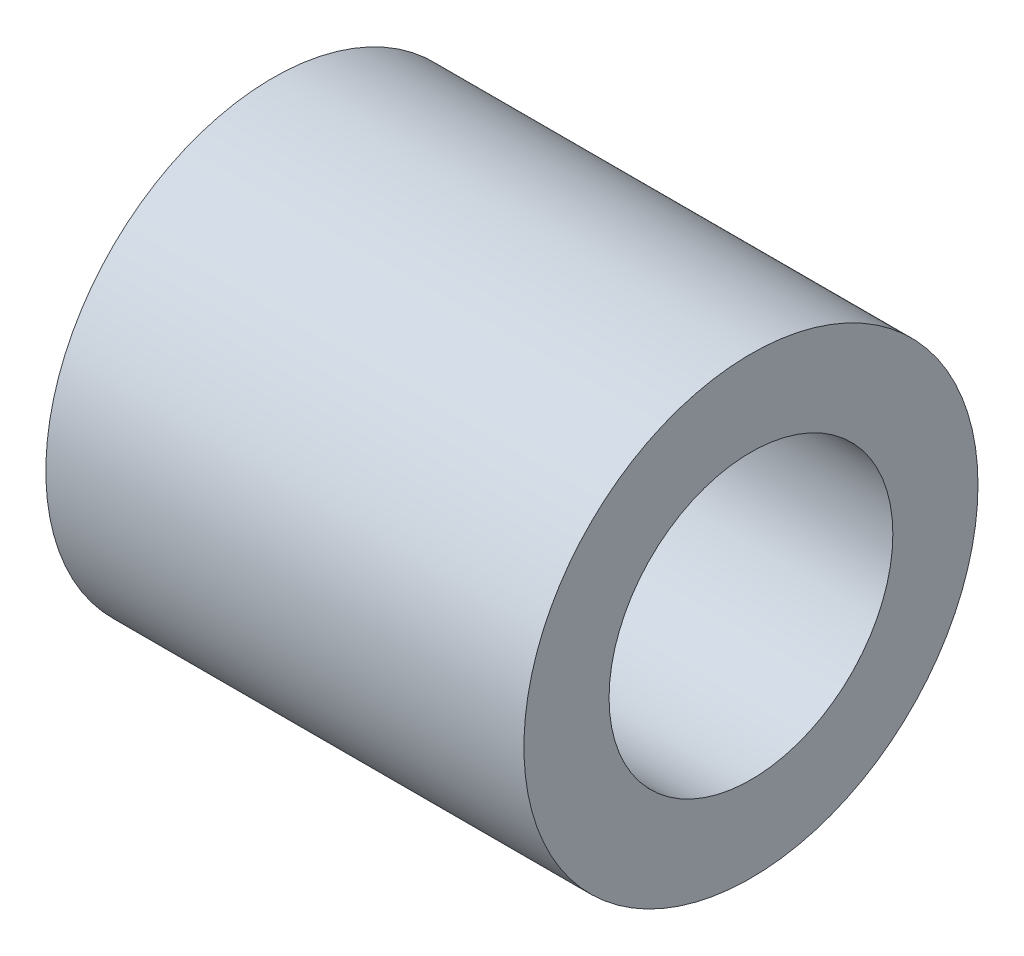
ISO-10303-21;
HEADER;
FILE_DESCRIPTION(('STEP AP214'),'2;1');
FILE_NAME('part.step','',(''),(''),'','','');
FILE_SCHEMA(('AUTOMOTIVE_DESIGN { 1 0 10303 214 1 1 1 1 }'));
ENDSEC;
DATA;
#1=APPLICATION_CONTEXT('core data for automotive mechanical design processes');
#2=APPLICATION_PROTOCOL_DEFINITION('international standard','automotive_design',2000,#1);
#3=PRODUCT_CONTEXT('',#1,'mechanical');
#4=PRODUCT('Part','Part','',(#3));
#5=PRODUCT_RELATED_PRODUCT_CATEGORY('part','',(#4));
#6=PRODUCT_DEFINITION_FORMATION('','',#4);
#7=PRODUCT_DEFINITION_CONTEXT('part definition',#1,'design');
#8=PRODUCT_DEFINITION('design','',#6,#7);
#9=PRODUCT_DEFINITION_SHAPE('','',#8);
#10=(LENGTH_UNIT() NAMED_UNIT(*) SI_UNIT(.MILLI.,.METRE.));
#11=(NAMED_UNIT(*) PLANE_ANGLE_UNIT() SI_UNIT($,.RADIAN.));
#12=(NAMED_UNIT(*) SI_UNIT($,.STERADIAN.) SOLID_ANGLE_UNIT());
#13=UNCERTAINTY_MEASURE_WITH_UNIT(LENGTH_MEASURE(1.E-05),#10,'distance_accuracy_value','');
#14=(GEOMETRIC_REPRESENTATION_CONTEXT(3) GLOBAL_UNCERTAINTY_ASSIGNED_CONTEXT((#13)) GLOBAL_UNIT_ASSIGNED_CONTEXT((#10,
#11,#12)) REPRESENTATION_CONTEXT('',''));
#15=CARTESIAN_POINT('',(0.,0.,0.));
#16=DIRECTION('',(0.,0.,1.));
#17=DIRECTION('',(1.,0.,0.));
#18=AXIS2_PLACEMENT_3D('',#15,#16,#17);
#19=CARTESIAN_POINT('',(9.,0.,0.));
#20=DIRECTION('',(-1.,0.,0.));
#21=DIRECTION('',(0.,0.,1.));
#22=AXIS2_PLACEMENT_3D('',#19,#20,#21);
#23=CYLINDRICAL_SURFACE('',#22,4.);
#24=CARTESIAN_POINT('',(0.577350269189625,0.,0.));
#25=DIRECTION('',(1.,0.,0.));
#26=DIRECTION('',(0.,0.,-1.));
#27=AXIS2_PLACEMENT_3D('',#24,#25,#26);
#28=CIRCLE('',#27,4.);
#29=CARTESIAN_POINT('',(0.577350269189625,0.,-4.));
#30=VERTEX_POINT('',#29);
#31=EDGE_CURVE('E45',#30,#30,#28,.T.);
#32=ORIENTED_EDGE('',*,*,#31,.T.);
#33=EDGE_LOOP('',(#32));
#34=FACE_BOUND('',#33,.T.);
#35=CARTESIAN_POINT('',(9.,0.,0.));
#36=DIRECTION('',(1.,0.,0.));
#37=DIRECTION('',(0.,0.,-1.));
#38=AXIS2_PLACEMENT_3D('',#35,#36,#37);
#39=CIRCLE('',#38,4.);
#40=CARTESIAN_POINT('',(9.,0.,-4.));
#41=VERTEX_POINT('',#40);
#42=EDGE_CURVE('E50',#41,#41,#39,.T.);
#43=ORIENTED_EDGE('',*,*,#42,.F.);
#44=EDGE_LOOP('',(#43));
#45=FACE_BOUND('',#44,.T.);
#46=ADVANCED_FACE('F37',(#34,#45),#23,.T.);
#47=CARTESIAN_POINT('',(9.,0.,0.));
#48=DIRECTION('',(1.,0.,0.));
#49=DIRECTION('',(0.,0.,-1.));
#50=AXIS2_PLACEMENT_3D('',#47,#48,#49);
#51=PLANE('',#50);
#52=CARTESIAN_POINT('',(9.,0.,0.));
#53=DIRECTION('',(1.,0.,0.));
#54=DIRECTION('',(0.,0.,-1.));
#55=AXIS2_PLACEMENT_3D('',#52,#53,#54);
#56=CIRCLE('',#55,2.5);
#57=CARTESIAN_POINT('',(9.,0.,-2.5));
#58=VERTEX_POINT('',#57);
#59=EDGE_CURVE('E58',#58,#58,#56,.T.);
#60=ORIENTED_EDGE('',*,*,#59,.F.);
#61=EDGE_LOOP('',(#60));
#62=FACE_BOUND('',#61,.T.);
#63=ORIENTED_EDGE('',*,*,#42,.T.);
#64=EDGE_LOOP('',(#63));
#65=FACE_BOUND('',#64,.T.);
#66=ADVANCED_FACE('F74',(#62,#65),#51,.T.);
#67=CARTESIAN_POINT('',(0.,0.,0.));
#68=DIRECTION('',(1.,0.,0.));
#69=DIRECTION('',(0.,0.,-1.));
#70=AXIS2_PLACEMENT_3D('',#67,#68,#69);
#71=PLANE('',#70);
#72=CARTESIAN_POINT('',(0.,0.,0.));
#73=DIRECTION('',(1.,0.,0.));
#74=DIRECTION('',(0.,0.,-1.));
#75=AXIS2_PLACEMENT_3D('',#72,#73,#74);
#76=CIRCLE('',#75,3.);
#77=CARTESIAN_POINT('',(0.,0.,-3.));
#78=VERTEX_POINT('',#77);
#79=EDGE_CURVE('E10',#78,#78,#76,.F.);
#80=ORIENTED_EDGE('',*,*,#79,.T.);
#81=EDGE_LOOP('',(#80));
#82=FACE_BOUND('',#81,.T.);
#83=ADVANCED_FACE('F77',(#82),#71,.F.);
#84=CARTESIAN_POINT('',(0.577350269189625,0.,0.));
#85=DIRECTION('',(1.,0.,0.));
#86=DIRECTION('',(0.,0.,-1.));
#87=AXIS2_PLACEMENT_3D('',#84,#85,#86);
#88=CONICAL_SURFACE('',#87,4.,1.0471975511966);
#89=ORIENTED_EDGE('',*,*,#79,.F.);
#90=EDGE_LOOP('',(#89));
#91=FACE_BOUND('',#90,.T.);
#92=ORIENTED_EDGE('',*,*,#31,.F.);
#93=EDGE_LOOP('',(#92));
#94=FACE_BOUND('',#93,.T.);
#95=ADVANCED_FACE('F39',(#91,#94),#88,.T.);
#96=CARTESIAN_POINT('',(3.,0.,0.));
#97=DIRECTION('',(1.,0.,0.));
#98=DIRECTION('',(0.,0.,-1.));
#99=AXIS2_PLACEMENT_3D('',#96,#97,#98);
#100=CYLINDRICAL_SURFACE('',#99,2.5);
#101=CARTESIAN_POINT('',(3.,0.,0.));
#102=DIRECTION('',(1.,0.,0.));
#103=DIRECTION('',(0.,0.,-1.));
#104=AXIS2_PLACEMENT_3D('',#101,#102,#103);
#105=CIRCLE('',#104,2.5);
#106=CARTESIAN_POINT('',(3.,0.,-2.5));
#107=VERTEX_POINT('',#106);
#108=EDGE_CURVE('E55',#107,#107,#105,.T.);
#109=ORIENTED_EDGE('',*,*,#108,.F.);
#110=EDGE_LOOP('',(#109));
#111=FACE_BOUND('',#110,.T.);
#112=ORIENTED_EDGE('',*,*,#59,.T.);
#113=EDGE_LOOP('',(#112));
#114=FACE_BOUND('',#113,.T.);
#115=ADVANCED_FACE('F68',(#111,#114),#100,.F.);
#116=CARTESIAN_POINT('',(3.,0.,0.));
#117=DIRECTION('',(1.,0.,0.));
#118=DIRECTION('',(0.,0.,-1.));
#119=AXIS2_PLACEMENT_3D('',#116,#117,#118);
#120=PLANE('',#119);
#121=ORIENTED_EDGE('',*,*,#108,.T.);
#122=EDGE_LOOP('',(#121));
#123=FACE_BOUND('',#122,.T.);
#124=ADVANCED_FACE('F66',(#123),#120,.T.);
#125=CLOSED_SHELL('',(#46,#66,#83,#95,#115,#124));
#126=MANIFOLD_SOLID_BREP('B2',#125);
#127=ADVANCED_BREP_SHAPE_REPRESENTATION('',(#18,#126),#14);
#128=SHAPE_DEFINITION_REPRESENTATION(#9,#127);
ENDSEC;
END-ISO-10303-21;
